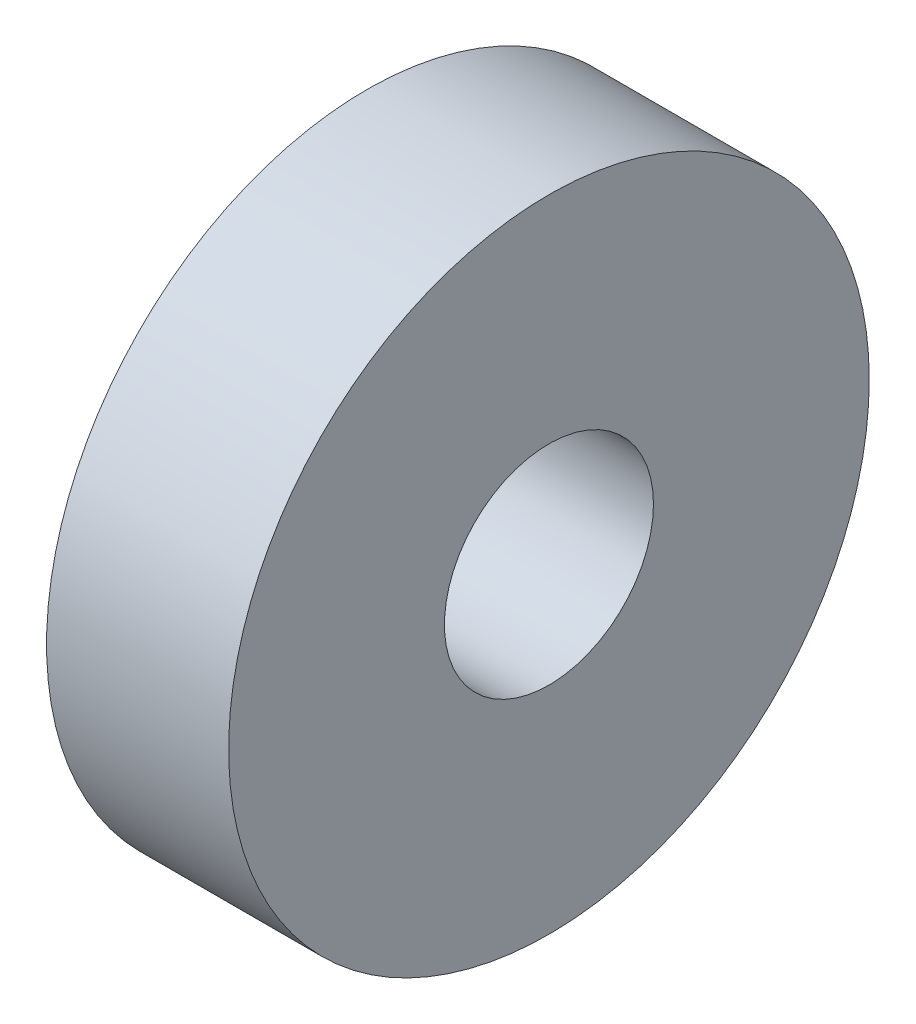
ISO-10303-21;
HEADER;
FILE_DESCRIPTION(('STEP AP214'),'2;1');
FILE_NAME('part.step','',(''),(''),'','','');
FILE_SCHEMA(('AUTOMOTIVE_DESIGN { 1 0 10303 214 1 1 1 1 }'));
ENDSEC;
DATA;
#1=APPLICATION_CONTEXT('core data for automotive mechanical design processes');
#2=APPLICATION_PROTOCOL_DEFINITION('international standard','automotive_design',2000,#1);
#3=PRODUCT_CONTEXT('',#1,'mechanical');
#4=PRODUCT('Part','Part','',(#3));
#5=PRODUCT_RELATED_PRODUCT_CATEGORY('part','',(#4));
#6=PRODUCT_DEFINITION_FORMATION('','',#4);
#7=PRODUCT_DEFINITION_CONTEXT('part definition',#1,'design');
#8=PRODUCT_DEFINITION('design','',#6,#7);
#9=PRODUCT_DEFINITION_SHAPE('','',#8);
#10=(LENGTH_UNIT() NAMED_UNIT(*) SI_UNIT(.MILLI.,.METRE.));
#11=(NAMED_UNIT(*) PLANE_ANGLE_UNIT() SI_UNIT($,.RADIAN.));
#12=(NAMED_UNIT(*) SI_UNIT($,.STERADIAN.) SOLID_ANGLE_UNIT());
#13=UNCERTAINTY_MEASURE_WITH_UNIT(LENGTH_MEASURE(1.E-05),#10,'distance_accuracy_value','');
#14=(GEOMETRIC_REPRESENTATION_CONTEXT(3) GLOBAL_UNCERTAINTY_ASSIGNED_CONTEXT((#13)) GLOBAL_UNIT_ASSIGNED_CONTEXT((#10,
#11,#12)) REPRESENTATION_CONTEXT('',''));
#15=CARTESIAN_POINT('',(0.,0.,0.));
#16=DIRECTION('',(0.,0.,1.));
#17=DIRECTION('',(1.,0.,0.));
#18=AXIS2_PLACEMENT_3D('',#15,#16,#17);
#19=CARTESIAN_POINT('',(3.429,0.,0.));
#20=DIRECTION('',(-1.,0.,0.));
#21=DIRECTION('',(0.,0.,1.));
#22=AXIS2_PLACEMENT_3D('',#19,#20,#21);
#23=CYLINDRICAL_SURFACE('',#22,12.065);
#24=CARTESIAN_POINT('',(3.429,0.,0.));
#25=DIRECTION('',(1.,0.,0.));
#26=DIRECTION('',(0.,0.,-1.));
#27=AXIS2_PLACEMENT_3D('',#24,#25,#26);
#28=CIRCLE('',#27,12.065);
#29=CARTESIAN_POINT('',(3.429,0.,-12.065));
#30=VERTEX_POINT('',#29);
#31=EDGE_CURVE('E10',#30,#30,#28,.T.);
#32=ORIENTED_EDGE('',*,*,#31,.F.);
#33=EDGE_LOOP('',(#32));
#34=FACE_BOUND('',#33,.T.);
#35=CARTESIAN_POINT('',(-3.429,0.,0.));
#36=DIRECTION('',(1.,0.,0.));
#37=DIRECTION('',(0.,0.,-1.));
#38=AXIS2_PLACEMENT_3D('',#35,#36,#37);
#39=CIRCLE('',#38,12.065);
#40=CARTESIAN_POINT('',(-3.429,0.,-12.065));
#41=VERTEX_POINT('',#40);
#42=EDGE_CURVE('E34',#41,#41,#39,.T.);
#43=ORIENTED_EDGE('',*,*,#42,.T.);
#44=EDGE_LOOP('',(#43));
#45=FACE_BOUND('',#44,.T.);
#46=ADVANCED_FACE('F31',(#34,#45),#23,.T.);
#47=CARTESIAN_POINT('',(3.429,0.,0.));
#48=DIRECTION('',(1.,0.,0.));
#49=DIRECTION('',(0.,0.,-1.));
#50=AXIS2_PLACEMENT_3D('',#47,#48,#49);
#51=PLANE('',#50);
#52=CARTESIAN_POINT('',(3.429,0.,0.));
#53=DIRECTION('',(1.,0.,0.));
#54=DIRECTION('',(0.,0.,-1.));
#55=AXIS2_PLACEMENT_3D('',#52,#53,#54);
#56=CIRCLE('',#55,3.937);
#57=CARTESIAN_POINT('',(3.429,0.,-3.937));
#58=VERTEX_POINT('',#57);
#59=EDGE_CURVE('E43',#58,#58,#56,.T.);
#60=ORIENTED_EDGE('',*,*,#59,.F.);
#61=EDGE_LOOP('',(#60));
#62=FACE_BOUND('',#61,.T.);
#63=ORIENTED_EDGE('',*,*,#31,.T.);
#64=EDGE_LOOP('',(#63));
#65=FACE_BOUND('',#64,.T.);
#66=ADVANCED_FACE('F58',(#62,#65),#51,.T.);
#67=CARTESIAN_POINT('',(-3.429,0.,0.));
#68=DIRECTION('',(1.,0.,0.));
#69=DIRECTION('',(0.,0.,-1.));
#70=AXIS2_PLACEMENT_3D('',#67,#68,#69);
#71=PLANE('',#70);
#72=CARTESIAN_POINT('',(-3.429,0.,0.));
#73=DIRECTION('',(1.,0.,0.));
#74=DIRECTION('',(0.,0.,-1.));
#75=AXIS2_PLACEMENT_3D('',#72,#73,#74);
#76=CIRCLE('',#75,3.937);
#77=CARTESIAN_POINT('',(-3.429,0.,-3.937));
#78=VERTEX_POINT('',#77);
#79=EDGE_CURVE('E41',#78,#78,#76,.T.);
#80=ORIENTED_EDGE('',*,*,#79,.T.);
#81=EDGE_LOOP('',(#80));
#82=FACE_BOUND('',#81,.T.);
#83=ORIENTED_EDGE('',*,*,#42,.F.);
#84=EDGE_LOOP('',(#83));
#85=FACE_BOUND('',#84,.T.);
#86=ADVANCED_FACE('F49',(#82,#85),#71,.F.);
#87=CARTESIAN_POINT('',(-3.429,0.,0.));
#88=DIRECTION('',(1.,0.,0.));
#89=DIRECTION('',(0.,0.,-1.));
#90=AXIS2_PLACEMENT_3D('',#87,#88,#89);
#91=CYLINDRICAL_SURFACE('',#90,3.937);
#92=ORIENTED_EDGE('',*,*,#79,.F.);
#93=EDGE_LOOP('',(#92));
#94=FACE_BOUND('',#93,.T.);
#95=ORIENTED_EDGE('',*,*,#59,.T.);
#96=EDGE_LOOP('',(#95));
#97=FACE_BOUND('',#96,.T.);
#98=ADVANCED_FACE('F52',(#94,#97),#91,.F.);
#99=CLOSED_SHELL('',(#46,#66,#86,#98));
#100=MANIFOLD_SOLID_BREP('B2',#99);
#101=ADVANCED_BREP_SHAPE_REPRESENTATION('',(#18,#100),#14);
#102=SHAPE_DEFINITION_REPRESENTATION(#9,#101);
ENDSEC;
END-ISO-10303-21;
